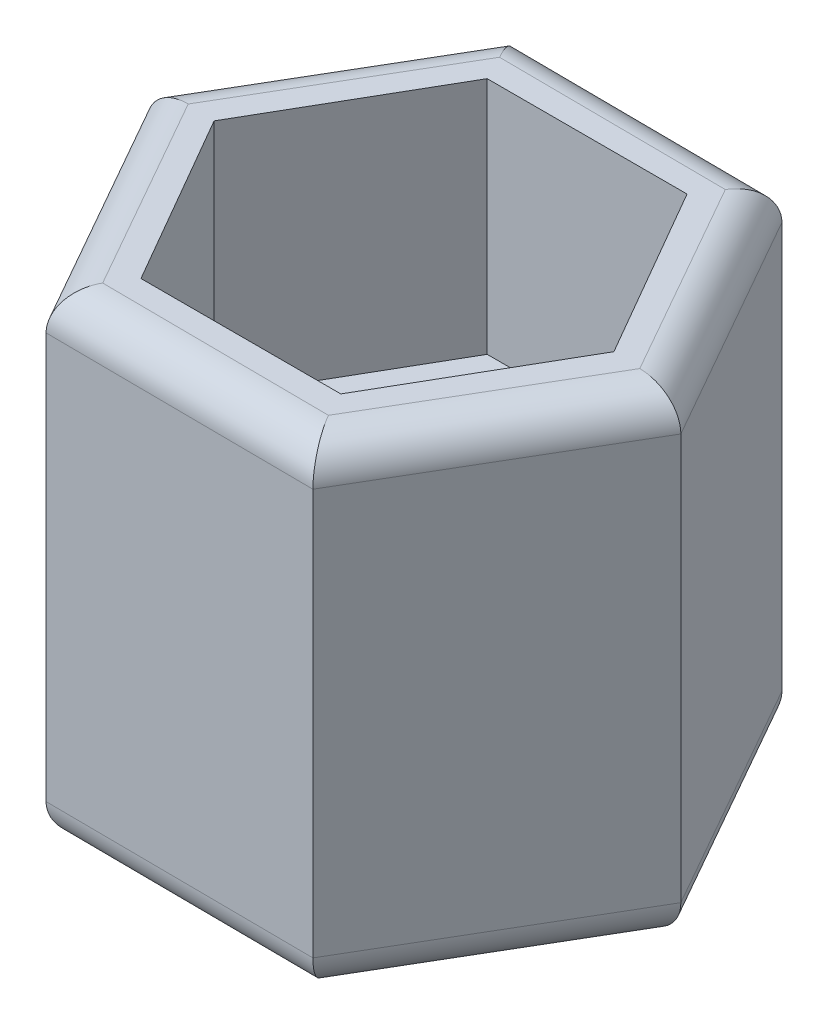
ISO-10303-21;
HEADER;
FILE_DESCRIPTION(('STEP AP214'),'2;1');
FILE_NAME('part.step','',(''),(''),'','','');
FILE_SCHEMA(('AUTOMOTIVE_DESIGN { 1 0 10303 214 1 1 1 1 }'));
ENDSEC;
DATA;
#1=APPLICATION_CONTEXT('core data for automotive mechanical design processes');
#2=APPLICATION_PROTOCOL_DEFINITION('international standard','automotive_design',2000,#1);
#3=PRODUCT_CONTEXT('',#1,'mechanical');
#4=PRODUCT('Part','Part','',(#3));
#5=PRODUCT_RELATED_PRODUCT_CATEGORY('part','',(#4));
#6=PRODUCT_DEFINITION_FORMATION('','',#4);
#7=PRODUCT_DEFINITION_CONTEXT('part definition',#1,'design');
#8=PRODUCT_DEFINITION('design','',#6,#7);
#9=PRODUCT_DEFINITION_SHAPE('','',#8);
#10=(LENGTH_UNIT() NAMED_UNIT(*) SI_UNIT(.MILLI.,.METRE.));
#11=(NAMED_UNIT(*) PLANE_ANGLE_UNIT() SI_UNIT($,.RADIAN.));
#12=(NAMED_UNIT(*) SI_UNIT($,.STERADIAN.) SOLID_ANGLE_UNIT());
#13=UNCERTAINTY_MEASURE_WITH_UNIT(LENGTH_MEASURE(1.E-05),#10,'distance_accuracy_value','');
#14=(GEOMETRIC_REPRESENTATION_CONTEXT(3) GLOBAL_UNCERTAINTY_ASSIGNED_CONTEXT((#13)) GLOBAL_UNIT_ASSIGNED_CONTEXT((#10,
#11,#12)) REPRESENTATION_CONTEXT('',''));
#15=CARTESIAN_POINT('',(0.,0.,0.));
#16=DIRECTION('',(0.,0.,1.));
#17=DIRECTION('',(1.,0.,0.));
#18=AXIS2_PLACEMENT_3D('',#15,#16,#17);
#19=CARTESIAN_POINT('',(-7.11414502554698,18.5,-4.17749213709434));
#20=DIRECTION('',(0.506362683284164,0.,-0.86232060915721));
#21=DIRECTION('',(-0.86232060915721,0.,-0.506362683284164));
#22=AXIS2_PLACEMENT_3D('',#19,#20,#21);
#23=CYLINDRICAL_SURFACE('',#22,1.5);
#24=CARTESIAN_POINT('',(-4.70226881565801,20.,-8.28484568264793));
#25=CARTESIAN_POINT('',(-5.20309159716499,20.,-9.16723663514376));
#26=CARTESIAN_POINT('',(-5.55722678214129,19.3786796564404,-9.7911812613112));
#27=CARTESIAN_POINT('',(-5.55722678214129,18.5,-9.7911812613112));
#28=(BOUNDED_CURVE() B_SPLINE_CURVE(3,(#24,#25,#26,#27),.UNSPECIFIED.,.F.,
.F.) B_SPLINE_CURVE_WITH_KNOTS((4,4),(1.5707963267949,3.1415926535898),
.UNSPECIFIED.) CURVE() GEOMETRIC_REPRESENTATION_ITEM() RATIONAL_B_SPLINE_CURVE((1.,
0.804737854124365,0.804737854124365,1.)) REPRESENTATION_ITEM(''));
#29=CARTESIAN_POINT('',(-4.70226881565801,20.,-8.28484568264793));
#30=VERTEX_POINT('',#29);
#31=CARTESIAN_POINT('',(-5.55722678214129,18.5,-9.7911812613112));
#32=VERTEX_POINT('',#31);
#33=EDGE_CURVE('E410',#30,#32,#28,.T.);
#34=ORIENTED_EDGE('',*,*,#33,.T.);
#35=DIRECTION('',(0.506362683284163,0.,-0.86232060915721));
#36=VECTOR('',#35,1.);
#37=CARTESIAN_POINT('',(-5.55722678214129,18.5,-9.7911812613112));
#38=LINE('',#37,#36);
#39=CARTESIAN_POINT('',(-11.2580250964243,18.5,-0.0828910627299843));
#40=VERTEX_POINT('',#39);
#41=EDGE_CURVE('E306',#40,#32,#38,.T.);
#42=ORIENTED_EDGE('',*,*,#41,.F.);
#43=CARTESIAN_POINT('',(-11.2580250964243,18.5,-0.0828910627299843));
#44=CARTESIAN_POINT('',(-11.2580250964243,19.3786796564404,-0.0828910627299863));
#45=CARTESIAN_POINT('',(-10.5406056071204,20.,-0.0776088162096358));
#46=CARTESIAN_POINT('',(-9.52602123543594,20.,-0.0701385915407576));
#47=(BOUNDED_CURVE() B_SPLINE_CURVE(3,(#43,#44,#45,#46),.UNSPECIFIED.,.F.,
.F.) B_SPLINE_CURVE_WITH_KNOTS((4,4),(0.,1.5707963267949),
.UNSPECIFIED.) CURVE() GEOMETRIC_REPRESENTATION_ITEM() RATIONAL_B_SPLINE_CURVE((1.,
0.804737854124365,0.804737854124365,1.)) REPRESENTATION_ITEM(''));
#48=CARTESIAN_POINT('',(-9.52602123543594,20.,-0.0701385915407576));
#49=VERTEX_POINT('',#48);
#50=EDGE_CURVE('E63',#40,#49,#47,.T.);
#51=ORIENTED_EDGE('',*,*,#50,.T.);
#52=DIRECTION('',(-0.506362683284163,0.,0.86232060915721));
#53=VECTOR('',#52,1.);
#54=CARTESIAN_POINT('',(-9.96454418268848,20.,0.67665296219626));
#55=LINE('',#54,#53);
#56=EDGE_CURVE('E299',#30,#49,#55,.T.);
#57=ORIENTED_EDGE('',*,*,#56,.F.);
#58=EDGE_LOOP('',(#34,#42,#51,#57));
#59=FACE_BOUND('',#58,.T.);
#60=ADVANCED_FACE('F55',(#59),#23,.T.);
#61=CARTESIAN_POINT('',(-7.17488682760694,18.5,4.07228424978321));
#62=DIRECTION('',(-0.493610212094935,0.,-0.869683251831144));
#63=DIRECTION('',(-0.869683251831144,0.,0.493610212094935));
#64=AXIS2_PLACEMENT_3D('',#61,#62,#63);
#65=CYLINDRICAL_SURFACE('',#64,1.5);
#66=CARTESIAN_POINT('',(-5.70079831428301,18.5,9.70829019858121));
#67=CARTESIAN_POINT('',(-5.70079831428301,19.3786796564404,9.7082901985812));
#68=CARTESIAN_POINT('',(-5.33751400995536,20.,9.08962781893411));
#69=CARTESIAN_POINT('',(-4.82375241977793,20.,8.21470709110717));
#70=(BOUNDED_CURVE() B_SPLINE_CURVE(3,(#66,#67,#68,#69),.UNSPECIFIED.,.F.,
.F.) B_SPLINE_CURVE_WITH_KNOTS((4,4),(3.1415926535898,4.71238898038469),
.UNSPECIFIED.) CURVE() GEOMETRIC_REPRESENTATION_ITEM() RATIONAL_B_SPLINE_CURVE((1.,
0.804737854124365,0.804737854124365,1.)) REPRESENTATION_ITEM(''));
#71=CARTESIAN_POINT('',(-5.70079831428301,18.5,9.70829019858121));
#72=VERTEX_POINT('',#71);
#73=CARTESIAN_POINT('',(-4.82375241977793,20.,8.21470709110717));
#74=VERTEX_POINT('',#73);
#75=EDGE_CURVE('E418',#72,#74,#70,.T.);
#76=ORIENTED_EDGE('',*,*,#75,.T.);
#77=DIRECTION('',(0.493610212094935,0.,0.869683251831144));
#78=VECTOR('',#77,1.);
#79=CARTESIAN_POINT('',(-4.39627343653629,20.,8.9678748804388));
#80=LINE('',#79,#78);
#81=EDGE_CURVE('E348',#49,#74,#80,.T.);
#82=ORIENTED_EDGE('',*,*,#81,.F.);
#83=ORIENTED_EDGE('',*,*,#50,.F.);
#84=DIRECTION('',(-0.493610212094935,0.,-0.869683251831144));
#85=VECTOR('',#84,1.);
#86=CARTESIAN_POINT('',(-11.2580250964243,18.5,-0.0828910627299848));
#87=LINE('',#86,#85);
#88=EDGE_CURVE('E281',#72,#40,#87,.T.);
#89=ORIENTED_EDGE('',*,*,#88,.F.);
#90=EDGE_LOOP('',(#76,#82,#83,#89));
#91=FACE_BOUND('',#90,.T.);
#92=ADVANCED_FACE('F481',(#91),#65,.T.);
#93=CARTESIAN_POINT('',(0.0607418020599588,18.5,-8.24977638687755));
#94=DIRECTION('',(0.999972895379098,0.,0.0073626426739344));
#95=DIRECTION('',(0.0073626426739344,0.,-0.999972895379098));
#96=AXIS2_PLACEMENT_3D('',#93,#94,#95);
#97=CYLINDRICAL_SURFACE('',#96,1.5);
#98=CARTESIAN_POINT('',(4.82375241977793,20.,-8.21470709110717));
#99=CARTESIAN_POINT('',(5.33751400995537,20.,-9.08962781893411));
#100=CARTESIAN_POINT('',(5.70079831428301,19.3786796564404,-9.7082901985812));
#101=CARTESIAN_POINT('',(5.70079831428301,18.5,-9.70829019858121));
#102=(BOUNDED_CURVE() B_SPLINE_CURVE(3,(#98,#99,#100,#101),.UNSPECIFIED.,.F.,
.F.) B_SPLINE_CURVE_WITH_KNOTS((4,4),(1.5707963267949,3.1415926535898),
.UNSPECIFIED.) CURVE() GEOMETRIC_REPRESENTATION_ITEM() RATIONAL_B_SPLINE_CURVE((1.,
0.804737854124365,0.804737854124365,1.)) REPRESENTATION_ITEM(''));
#103=CARTESIAN_POINT('',(4.82375241977793,20.,-8.21470709110717));
#104=VERTEX_POINT('',#103);
#105=CARTESIAN_POINT('',(5.70079831428301,18.5,-9.70829019858121));
#106=VERTEX_POINT('',#105);
#107=EDGE_CURVE('E450',#104,#106,#102,.T.);
#108=ORIENTED_EDGE('',*,*,#107,.T.);
#109=DIRECTION('',(0.999972895379098,0.,0.0073626426739344));
#110=VECTOR('',#109,1.);
#111=CARTESIAN_POINT('',(5.70079831428301,18.5,-9.70829019858121));
#112=LINE('',#111,#110);
#113=EDGE_CURVE('E294',#32,#106,#112,.T.);
#114=ORIENTED_EDGE('',*,*,#113,.F.);
#115=ORIENTED_EDGE('',*,*,#33,.F.);
#116=DIRECTION('',(-0.999972895379098,0.,-0.0073626426739344));
#117=VECTOR('',#116,1.);
#118=CARTESIAN_POINT('',(-5.56827074615219,20.,-8.29122191824255));
#119=LINE('',#118,#117);
#120=EDGE_CURVE('E295',#104,#30,#119,.T.);
#121=ORIENTED_EDGE('',*,*,#120,.F.);
#122=EDGE_LOOP('',(#108,#114,#115,#121));
#123=FACE_BOUND('',#122,.T.);
#124=ADVANCED_FACE('F488',(#123),#97,.T.);
#125=CARTESIAN_POINT('',(-0.0607418020599575,18.5,8.24977638687755));
#126=DIRECTION('',(-0.999972895379098,0.,-0.00736264267393425));
#127=DIRECTION('',(-0.00736264267393425,0.,0.999972895379098));
#128=AXIS2_PLACEMENT_3D('',#125,#126,#127);
#129=CYLINDRICAL_SURFACE('',#128,1.5);
#130=CARTESIAN_POINT('',(5.55722678214129,18.5,9.79118126131119));
#131=CARTESIAN_POINT('',(5.55722678214129,19.3786796564404,9.79118126131119));
#132=CARTESIAN_POINT('',(5.203091597165,20.,9.16723663514376));
#133=CARTESIAN_POINT('',(4.70226881565802,20.,8.28484568264793));
#134=(BOUNDED_CURVE() B_SPLINE_CURVE(3,(#130,#131,#132,#133),.UNSPECIFIED.,.F.,
.F.) B_SPLINE_CURVE_WITH_KNOTS((4,4),(3.1415926535898,4.71238898038469),
.UNSPECIFIED.) CURVE() GEOMETRIC_REPRESENTATION_ITEM() RATIONAL_B_SPLINE_CURVE((1.,
0.804737854124365,0.804737854124365,1.)) REPRESENTATION_ITEM(''));
#135=CARTESIAN_POINT('',(5.55722678214129,18.5,9.79118126131119));
#136=VERTEX_POINT('',#135);
#137=CARTESIAN_POINT('',(4.70226881565802,20.,8.28484568264793));
#138=VERTEX_POINT('',#137);
#139=EDGE_CURVE('E434',#136,#138,#134,.T.);
#140=ORIENTED_EDGE('',*,*,#139,.T.);
#141=DIRECTION('',(0.999972895379098,0.,0.00736264267393425));
#142=VECTOR('',#141,1.);
#143=CARTESIAN_POINT('',(5.56827074615219,20.,8.29122191824255));
#144=LINE('',#143,#142);
#145=EDGE_CURVE('E352',#74,#138,#144,.T.);
#146=ORIENTED_EDGE('',*,*,#145,.F.);
#147=ORIENTED_EDGE('',*,*,#75,.F.);
#148=DIRECTION('',(-0.999972895379098,0.,-0.00736264267393425));
#149=VECTOR('',#148,1.);
#150=CARTESIAN_POINT('',(-5.70079831428301,18.5,9.70829019858121));
#151=LINE('',#150,#149);
#152=EDGE_CURVE('E324',#136,#72,#151,.T.);
#153=ORIENTED_EDGE('',*,*,#152,.F.);
#154=EDGE_LOOP('',(#140,#146,#147,#153));
#155=FACE_BOUND('',#154,.T.);
#156=ADVANCED_FACE('F626',(#155),#129,.T.);
#157=CARTESIAN_POINT('',(7.17488682760694,18.5,-4.07228424978321));
#158=DIRECTION('',(0.493610212094934,0.,0.869683251831145));
#159=DIRECTION('',(0.869683251831145,0.,-0.493610212094934));
#160=AXIS2_PLACEMENT_3D('',#157,#158,#159);
#161=CYLINDRICAL_SURFACE('',#160,1.5);
#162=CARTESIAN_POINT('',(9.52602123543595,20.,0.0701385915407602));
#163=CARTESIAN_POINT('',(10.5406056071204,20.,0.0776088162096386));
#164=CARTESIAN_POINT('',(11.2580250964243,19.3786796564404,0.0828910627299895));
#165=CARTESIAN_POINT('',(11.2580250964243,18.5,0.082891062729986));
#166=(BOUNDED_CURVE() B_SPLINE_CURVE(3,(#162,#163,#164,#165),.UNSPECIFIED.,.F.,
.F.) B_SPLINE_CURVE_WITH_KNOTS((4,4),(1.5707963267949,3.1415926535898),
.UNSPECIFIED.) CURVE() GEOMETRIC_REPRESENTATION_ITEM() RATIONAL_B_SPLINE_CURVE((1.,
0.804737854124365,0.804737854124365,1.)) REPRESENTATION_ITEM(''));
#167=CARTESIAN_POINT('',(9.52602123543595,20.,0.0701385915407602));
#168=VERTEX_POINT('',#167);
#169=CARTESIAN_POINT('',(11.2580250964243,18.5,0.082891062729986));
#170=VERTEX_POINT('',#169);
#171=EDGE_CURVE('E442',#168,#170,#166,.T.);
#172=ORIENTED_EDGE('',*,*,#171,.T.);
#173=DIRECTION('',(0.493610212094934,0.,0.869683251831145));
#174=VECTOR('',#173,1.);
#175=CARTESIAN_POINT('',(11.2580250964243,18.5,0.0828910627299882));
#176=LINE('',#175,#174);
#177=EDGE_CURVE('E276',#106,#170,#176,.T.);
#178=ORIENTED_EDGE('',*,*,#177,.F.);
#179=ORIENTED_EDGE('',*,*,#107,.F.);
#180=DIRECTION('',(-0.493610212094934,0.,-0.869683251831145));
#181=VECTOR('',#180,1.);
#182=CARTESIAN_POINT('',(4.39627343653629,20.,-8.96787488043881));
#183=LINE('',#182,#181);
#184=EDGE_CURVE('E360',#168,#104,#183,.T.);
#185=ORIENTED_EDGE('',*,*,#184,.F.);
#186=EDGE_LOOP('',(#172,#178,#179,#185));
#187=FACE_BOUND('',#186,.T.);
#188=ADVANCED_FACE('F631',(#187),#161,.T.);
#189=CARTESIAN_POINT('',(7.11414502554698,18.5,4.17749213709434));
#190=DIRECTION('',(-0.506362683284163,0.,0.86232060915721));
#191=DIRECTION('',(0.86232060915721,0.,0.506362683284163));
#192=AXIS2_PLACEMENT_3D('',#189,#190,#191);
#193=CYLINDRICAL_SURFACE('',#192,1.5);
#194=ORIENTED_EDGE('',*,*,#139,.F.);
#195=DIRECTION('',(-0.506362683284163,0.,0.86232060915721));
#196=VECTOR('',#195,1.);
#197=CARTESIAN_POINT('',(5.55722678214129,18.5,9.79118126131119));
#198=LINE('',#197,#196);
#199=EDGE_CURVE('E300',#170,#136,#198,.T.);
#200=ORIENTED_EDGE('',*,*,#199,.F.);
#201=ORIENTED_EDGE('',*,*,#171,.F.);
#202=DIRECTION('',(0.506362683284163,0.,-0.86232060915721));
#203=VECTOR('',#202,1.);
#204=CARTESIAN_POINT('',(9.96454418268849,20.,-0.676652962196258));
#205=LINE('',#204,#203);
#206=EDGE_CURVE('E356',#138,#168,#205,.T.);
#207=ORIENTED_EDGE('',*,*,#206,.F.);
#208=EDGE_LOOP('',(#194,#200,#201,#207));
#209=FACE_BOUND('',#208,.T.);
#210=ADVANCED_FACE('F635',(#209),#193,.T.);
#211=CARTESIAN_POINT('',(9.95350021867759,1.5,0.823306380872388));
#212=DIRECTION('',(-0.493610212094935,0.,-0.869683251831144));
#213=DIRECTION('',(-0.869683251831144,0.,0.493610212094935));
#214=AXIS2_PLACEMENT_3D('',#211,#212,#213);
#215=CYLINDRICAL_SURFACE('',#214,1.5);
#216=CARTESIAN_POINT('',(11.2580250964243,1.5,0.082891062729986));
#217=CARTESIAN_POINT('',(11.2580250964243,0.621320343559643,0.0828910627299883));
#218=CARTESIAN_POINT('',(10.5406056071204,0.,0.0776088162096375));
#219=CARTESIAN_POINT('',(9.52602123543595,0.,0.0701385915407584));
#220=(BOUNDED_CURVE() B_SPLINE_CURVE(3,(#216,#217,#218,#219),.UNSPECIFIED.,.F.,
.F.) B_SPLINE_CURVE_WITH_KNOTS((4,4),(0.,1.5707963267949),
.UNSPECIFIED.) CURVE() GEOMETRIC_REPRESENTATION_ITEM() RATIONAL_B_SPLINE_CURVE((1.,
0.804737854124365,0.804737854124365,1.)) REPRESENTATION_ITEM(''));
#221=CARTESIAN_POINT('',(11.2580250964243,1.5,0.082891062729986));
#222=VERTEX_POINT('',#221);
#223=CARTESIAN_POINT('',(9.52602123543595,0.,0.0701385915407584));
#224=VERTEX_POINT('',#223);
#225=EDGE_CURVE('E383',#222,#224,#220,.T.);
#226=ORIENTED_EDGE('',*,*,#225,.T.);
#227=DIRECTION('',(0.493610212094934,0.,0.869683251831145));
#228=VECTOR('',#227,1.);
#229=CARTESIAN_POINT('',(7.17488682760694,0.,-4.07228424978321));
#230=LINE('',#229,#228);
#231=CARTESIAN_POINT('',(4.82375241977793,0.,-8.21470709110717));
#232=VERTEX_POINT('',#231);
#233=EDGE_CURVE('E368',#232,#224,#230,.T.);
#234=ORIENTED_EDGE('',*,*,#233,.F.);
#235=CARTESIAN_POINT('',(4.82375241977793,0.,-8.21470709110717));
#236=CARTESIAN_POINT('',(5.33751400995536,0.,-9.08962781893411));
#237=CARTESIAN_POINT('',(5.70079831428301,0.621320343559643,-9.70829019858121));
#238=CARTESIAN_POINT('',(5.70079831428301,1.5,-9.70829019858121));
#239=(BOUNDED_CURVE() B_SPLINE_CURVE(3,(#235,#236,#237,#238),.UNSPECIFIED.,.F.,
.F.) B_SPLINE_CURVE_WITH_KNOTS((4,4),(1.5707963267949,3.1415926535898),
.UNSPECIFIED.) CURVE() GEOMETRIC_REPRESENTATION_ITEM() RATIONAL_B_SPLINE_CURVE((1.,
0.804737854124365,0.804737854124365,1.)) REPRESENTATION_ITEM(''));
#240=CARTESIAN_POINT('',(5.70079831428301,1.5,-9.70829019858121));
#241=VERTEX_POINT('',#240);
#242=EDGE_CURVE('E426',#232,#241,#239,.T.);
#243=ORIENTED_EDGE('',*,*,#242,.T.);
#244=DIRECTION('',(-0.493610212094934,0.,-0.869683251831145));
#245=VECTOR('',#244,1.);
#246=CARTESIAN_POINT('',(11.2580250964243,1.5,0.082891062729986));
#247=LINE('',#246,#245);
#248=EDGE_CURVE('E268',#222,#241,#247,.T.);
#249=ORIENTED_EDGE('',*,*,#248,.F.);
#250=EDGE_LOOP('',(#226,#234,#243,#249));
#251=FACE_BOUND('',#250,.T.);
#252=ADVANCED_FACE('F637',(#251),#215,.T.);
#253=CARTESIAN_POINT('',(5.68975435027211,1.5,-8.20833085551256));
#254=DIRECTION('',(-0.999972895379098,0.,-0.00736264267393467));
#255=DIRECTION('',(-0.00736264267393467,0.,0.999972895379098));
#256=AXIS2_PLACEMENT_3D('',#253,#254,#255);
#257=CYLINDRICAL_SURFACE('',#256,1.5);
#258=CARTESIAN_POINT('',(-4.70226881565801,0.,-8.28484568264793));
#259=CARTESIAN_POINT('',(-5.203091597165,0.,-9.16723663514374));
#260=CARTESIAN_POINT('',(-5.55722678214129,0.621320343559643,-9.79118126131119));
#261=CARTESIAN_POINT('',(-5.55722678214129,1.5,-9.7911812613112));
#262=(BOUNDED_CURVE() B_SPLINE_CURVE(3,(#258,#259,#260,#261),.UNSPECIFIED.,.F.,
.F.) B_SPLINE_CURVE_WITH_KNOTS((4,4),(1.5707963267949,3.1415926535898),
.UNSPECIFIED.) CURVE() GEOMETRIC_REPRESENTATION_ITEM() RATIONAL_B_SPLINE_CURVE((1.,
0.804737854124365,0.804737854124365,1.)) REPRESENTATION_ITEM(''));
#263=CARTESIAN_POINT('',(-4.70226881565801,0.,-8.28484568264793));
#264=VERTEX_POINT('',#263);
#265=CARTESIAN_POINT('',(-5.55722678214129,1.5,-9.7911812613112));
#266=VERTEX_POINT('',#265);
#267=EDGE_CURVE('E378',#264,#266,#262,.T.);
#268=ORIENTED_EDGE('',*,*,#267,.T.);
#269=DIRECTION('',(-0.999972895379098,0.,-0.0073626426739344));
#270=VECTOR('',#269,1.);
#271=CARTESIAN_POINT('',(5.70079831428301,1.5,-9.70829019858121));
#272=LINE('',#271,#270);
#273=EDGE_CURVE('E280',#241,#266,#272,.T.);
#274=ORIENTED_EDGE('',*,*,#273,.F.);
#275=ORIENTED_EDGE('',*,*,#242,.F.);
#276=DIRECTION('',(0.999972895379098,0.,0.0073626426739344));
#277=VECTOR('',#276,1.);
#278=CARTESIAN_POINT('',(0.0607418020599588,0.,-8.24977638687755));
#279=LINE('',#278,#277);
#280=EDGE_CURVE('E364',#264,#232,#279,.T.);
#281=ORIENTED_EDGE('',*,*,#280,.F.);
#282=EDGE_LOOP('',(#268,#274,#275,#281));
#283=FACE_BOUND('',#282,.T.);
#284=ADVANCED_FACE('F640',(#283),#257,.T.);
#285=CARTESIAN_POINT('',(4.26374586840548,1.5,9.03163723638495));
#286=DIRECTION('',(0.506362683284163,0.,-0.86232060915721));
#287=DIRECTION('',(-0.862320609157211,0.,-0.506362683284163));
#288=AXIS2_PLACEMENT_3D('',#285,#286,#287);
#289=CYLINDRICAL_SURFACE('',#288,1.5);
#290=CARTESIAN_POINT('',(5.55722678214129,1.5,9.79118126131119));
#291=CARTESIAN_POINT('',(5.55722678214129,0.621320343559643,9.79118126131119));
#292=CARTESIAN_POINT('',(5.203091597165,0.,9.16723663514374));
#293=CARTESIAN_POINT('',(4.70226881565802,0.,8.28484568264793));
#294=(BOUNDED_CURVE() B_SPLINE_CURVE(3,(#290,#291,#292,#293),.UNSPECIFIED.,.F.,
.F.) B_SPLINE_CURVE_WITH_KNOTS((4,4),(3.1415926535898,4.71238898038469),
.UNSPECIFIED.) CURVE() GEOMETRIC_REPRESENTATION_ITEM() RATIONAL_B_SPLINE_CURVE((1.,
0.804737854124365,0.804737854124365,1.)) REPRESENTATION_ITEM(''));
#295=CARTESIAN_POINT('',(5.55722678214129,1.5,9.79118126131119));
#296=VERTEX_POINT('',#295);
#297=CARTESIAN_POINT('',(4.70226881565802,0.,8.28484568264793));
#298=VERTEX_POINT('',#297);
#299=EDGE_CURVE('E334',#296,#298,#294,.T.);
#300=ORIENTED_EDGE('',*,*,#299,.T.);
#301=DIRECTION('',(-0.506362683284163,0.,0.86232060915721));
#302=VECTOR('',#301,1.);
#303=CARTESIAN_POINT('',(7.11414502554698,0.,4.17749213709434));
#304=LINE('',#303,#302);
#305=EDGE_CURVE('E372',#224,#298,#304,.T.);
#306=ORIENTED_EDGE('',*,*,#305,.F.);
#307=ORIENTED_EDGE('',*,*,#225,.F.);
#308=DIRECTION('',(0.506362683284163,0.,-0.86232060915721));
#309=VECTOR('',#308,1.);
#310=CARTESIAN_POINT('',(5.55722678214129,1.5,9.79118126131119));
#311=LINE('',#310,#309);
#312=EDGE_CURVE('E328',#296,#222,#311,.T.);
#313=ORIENTED_EDGE('',*,*,#312,.F.);
#314=EDGE_LOOP('',(#300,#306,#307,#313));
#315=FACE_BOUND('',#314,.T.);
#316=ADVANCED_FACE('F644',(#315),#289,.T.);
#317=CARTESIAN_POINT('',(-4.26374586840548,1.5,-9.03163723638495));
#318=DIRECTION('',(-0.506362683284163,0.,0.862320609157211));
#319=DIRECTION('',(0.862320609157211,0.,0.506362683284163));
#320=AXIS2_PLACEMENT_3D('',#317,#318,#319);
#321=CYLINDRICAL_SURFACE('',#320,1.5);
#322=CARTESIAN_POINT('',(-9.52602123543595,0.,-0.0701385915407558));
#323=CARTESIAN_POINT('',(-10.5406056071204,0.,-0.0776088162096339));
#324=CARTESIAN_POINT('',(-11.2580250964243,0.621320343559643,-0.0828910627299844));
#325=CARTESIAN_POINT('',(-11.2580250964243,1.5,-0.0828910627299843));
#326=(BOUNDED_CURVE() B_SPLINE_CURVE(3,(#322,#323,#324,#325),.UNSPECIFIED.,.F.,
.F.) B_SPLINE_CURVE_WITH_KNOTS((4,4),(1.5707963267949,3.1415926535898),
.UNSPECIFIED.) CURVE() GEOMETRIC_REPRESENTATION_ITEM() RATIONAL_B_SPLINE_CURVE((1.,
0.804737854124365,0.804737854124365,1.)) REPRESENTATION_ITEM(''));
#327=CARTESIAN_POINT('',(-9.52602123543595,0.,-0.0701385915407558));
#328=VERTEX_POINT('',#327);
#329=CARTESIAN_POINT('',(-11.2580250964243,1.5,-0.0828910627299843));
#330=VERTEX_POINT('',#329);
#331=EDGE_CURVE('E335',#328,#330,#326,.T.);
#332=ORIENTED_EDGE('',*,*,#331,.T.);
#333=DIRECTION('',(-0.506362683284163,0.,0.86232060915721));
#334=VECTOR('',#333,1.);
#335=CARTESIAN_POINT('',(-5.55722678214129,1.5,-9.7911812613112));
#336=LINE('',#335,#334);
#337=EDGE_CURVE('E301',#266,#330,#336,.T.);
#338=ORIENTED_EDGE('',*,*,#337,.F.);
#339=ORIENTED_EDGE('',*,*,#267,.F.);
#340=DIRECTION('',(0.506362683284163,0.,-0.86232060915721));
#341=VECTOR('',#340,1.);
#342=CARTESIAN_POINT('',(-7.11414502554698,0.,-4.17749213709434));
#343=LINE('',#342,#341);
#344=EDGE_CURVE('E390',#328,#264,#343,.T.);
#345=ORIENTED_EDGE('',*,*,#344,.F.);
#346=EDGE_LOOP('',(#332,#338,#339,#345));
#347=FACE_BOUND('',#346,.T.);
#348=ADVANCED_FACE('F648',(#347),#321,.T.);
#349=CARTESIAN_POINT('',(-5.68975435027211,1.5,8.20833085551256));
#350=DIRECTION('',(0.999972895379098,0.,0.00736264267393409));
#351=DIRECTION('',(0.00736264267393409,0.,-0.999972895379098));
#352=AXIS2_PLACEMENT_3D('',#349,#350,#351);
#353=CYLINDRICAL_SURFACE('',#352,1.5);
#354=CARTESIAN_POINT('',(-5.70079831428301,1.5,9.70829019858121));
#355=CARTESIAN_POINT('',(-5.700798314283,0.621320343559643,9.7082901985812));
#356=CARTESIAN_POINT('',(-5.33751400995536,0.,9.08962781893411));
#357=CARTESIAN_POINT('',(-4.82375241977793,0.,8.21470709110717));
#358=(BOUNDED_CURVE() B_SPLINE_CURVE(3,(#354,#355,#356,#357),.UNSPECIFIED.,.F.,
.F.) B_SPLINE_CURVE_WITH_KNOTS((4,4),(3.1415926535898,4.71238898038469),
.UNSPECIFIED.) CURVE() GEOMETRIC_REPRESENTATION_ITEM() RATIONAL_B_SPLINE_CURVE((1.,
0.804737854124365,0.804737854124365,1.)) REPRESENTATION_ITEM(''));
#359=CARTESIAN_POINT('',(-5.70079831428301,1.5,9.70829019858121));
#360=VERTEX_POINT('',#359);
#361=CARTESIAN_POINT('',(-4.82375241977793,0.,8.21470709110717));
#362=VERTEX_POINT('',#361);
#363=EDGE_CURVE('E329',#360,#362,#358,.T.);
#364=ORIENTED_EDGE('',*,*,#363,.T.);
#365=DIRECTION('',(-0.999972895379098,0.,-0.00736264267393425));
#366=VECTOR('',#365,1.);
#367=CARTESIAN_POINT('',(-0.0607418020599575,0.,8.24977638687755));
#368=LINE('',#367,#366);
#369=EDGE_CURVE('E373',#298,#362,#368,.T.);
#370=ORIENTED_EDGE('',*,*,#369,.F.);
#371=ORIENTED_EDGE('',*,*,#299,.F.);
#372=DIRECTION('',(0.999972895379098,0.,0.00736264267393425));
#373=VECTOR('',#372,1.);
#374=CARTESIAN_POINT('',(-5.70079831428301,1.5,9.70829019858121));
#375=LINE('',#374,#373);
#376=EDGE_CURVE('E285',#360,#296,#375,.T.);
#377=ORIENTED_EDGE('',*,*,#376,.F.);
#378=EDGE_LOOP('',(#364,#370,#371,#377));
#379=FACE_BOUND('',#378,.T.);
#380=ADVANCED_FACE('F652',(#379),#353,.T.);
#381=CARTESIAN_POINT('',(-9.95350021867758,1.5,-0.823306380872386));
#382=DIRECTION('',(0.493610212094935,0.,0.869683251831144));
#383=DIRECTION('',(0.869683251831144,0.,-0.493610212094935));
#384=AXIS2_PLACEMENT_3D('',#381,#382,#383);
#385=CYLINDRICAL_SURFACE('',#384,1.5);
#386=ORIENTED_EDGE('',*,*,#331,.F.);
#387=DIRECTION('',(-0.493610212094935,0.,-0.869683251831144));
#388=VECTOR('',#387,1.);
#389=CARTESIAN_POINT('',(-7.17488682760694,0.,4.07228424978321));
#390=LINE('',#389,#388);
#391=EDGE_CURVE('E377',#362,#328,#390,.T.);
#392=ORIENTED_EDGE('',*,*,#391,.F.);
#393=ORIENTED_EDGE('',*,*,#363,.F.);
#394=DIRECTION('',(0.493610212094935,0.,0.869683251831144));
#395=VECTOR('',#394,1.);
#396=CARTESIAN_POINT('',(-11.2580250964243,1.5,-0.0828910627299843));
#397=LINE('',#396,#395);
#398=EDGE_CURVE('E310',#330,#360,#397,.T.);
#399=ORIENTED_EDGE('',*,*,#398,.F.);
#400=EDGE_LOOP('',(#386,#392,#393,#399));
#401=FACE_BOUND('',#400,.T.);
#402=ADVANCED_FACE('F616',(#401),#385,.T.);
#403=CARTESIAN_POINT('',(0.,0.,0.));
#404=DIRECTION('',(0.,1.,0.));
#405=DIRECTION('',(1.,0.,0.));
#406=AXIS2_PLACEMENT_3D('',#403,#404,#405);
#407=PLANE('',#406);
#408=ORIENTED_EDGE('',*,*,#280,.T.);
#409=ORIENTED_EDGE('',*,*,#233,.T.);
#410=ORIENTED_EDGE('',*,*,#305,.T.);
#411=ORIENTED_EDGE('',*,*,#369,.T.);
#412=ORIENTED_EDGE('',*,*,#391,.T.);
#413=ORIENTED_EDGE('',*,*,#344,.T.);
#414=EDGE_LOOP('',(#408,#409,#410,#411,#412,#413));
#415=FACE_BOUND('',#414,.T.);
#416=ADVANCED_FACE('F608',(#415),#407,.F.);
#417=CARTESIAN_POINT('',(0.,20.,0.));
#418=DIRECTION('',(0.,1.,0.));
#419=DIRECTION('',(1.,0.,0.));
#420=AXIS2_PLACEMENT_3D('',#417,#418,#419);
#421=PLANE('',#420);
#422=DIRECTION('',(0.5,0.,-0.866025403784439));
#423=VECTOR('',#422,1.);
#424=CARTESIAN_POINT('',(4.18578945162479,20.,7.25));
#425=LINE('',#424,#423);
#426=CARTESIAN_POINT('',(4.18578945162479,20.,7.25));
#427=VERTEX_POINT('',#426);
#428=CARTESIAN_POINT('',(8.37157890324957,20.,0.));
#429=VERTEX_POINT('',#428);
#430=EDGE_CURVE('E553',#427,#429,#425,.T.);
#431=ORIENTED_EDGE('',*,*,#430,.F.);
#432=DIRECTION('',(1.,0.,0.));
#433=VECTOR('',#432,1.);
#434=CARTESIAN_POINT('',(-4.18578945162479,20.,7.25));
#435=LINE('',#434,#433);
#436=CARTESIAN_POINT('',(-4.18578945162479,20.,7.25));
#437=VERTEX_POINT('',#436);
#438=EDGE_CURVE('E523',#437,#427,#435,.T.);
#439=ORIENTED_EDGE('',*,*,#438,.F.);
#440=DIRECTION('',(0.5,0.,0.866025403784438));
#441=VECTOR('',#440,1.);
#442=CARTESIAN_POINT('',(-8.37157890324958,20.,0.));
#443=LINE('',#442,#441);
#444=CARTESIAN_POINT('',(-8.37157890324958,20.,0.));
#445=VERTEX_POINT('',#444);
#446=EDGE_CURVE('E565',#445,#437,#443,.T.);
#447=ORIENTED_EDGE('',*,*,#446,.F.);
#448=DIRECTION('',(-0.5,0.,0.866025403784438));
#449=VECTOR('',#448,1.);
#450=CARTESIAN_POINT('',(-4.18578945162479,20.,-7.25));
#451=LINE('',#450,#449);
#452=CARTESIAN_POINT('',(-4.18578945162479,20.,-7.25));
#453=VERTEX_POINT('',#452);
#454=EDGE_CURVE('E562',#453,#445,#451,.T.);
#455=ORIENTED_EDGE('',*,*,#454,.F.);
#456=DIRECTION('',(-1.,0.,0.));
#457=VECTOR('',#456,1.);
#458=CARTESIAN_POINT('',(4.18578945162478,20.,-7.25));
#459=LINE('',#458,#457);
#460=CARTESIAN_POINT('',(4.18578945162478,20.,-7.25));
#461=VERTEX_POINT('',#460);
#462=EDGE_CURVE('E559',#461,#453,#459,.T.);
#463=ORIENTED_EDGE('',*,*,#462,.F.);
#464=DIRECTION('',(-0.5,0.,-0.866025403784438));
#465=VECTOR('',#464,1.);
#466=CARTESIAN_POINT('',(8.37157890324957,20.,0.));
#467=LINE('',#466,#465);
#468=EDGE_CURVE('E556',#429,#461,#467,.T.);
#469=ORIENTED_EDGE('',*,*,#468,.F.);
#470=EDGE_LOOP('',(#431,#439,#447,#455,#463,#469));
#471=FACE_BOUND('',#470,.T.);
#472=ORIENTED_EDGE('',*,*,#120,.T.);
#473=ORIENTED_EDGE('',*,*,#56,.T.);
#474=ORIENTED_EDGE('',*,*,#81,.T.);
#475=ORIENTED_EDGE('',*,*,#145,.T.);
#476=ORIENTED_EDGE('',*,*,#206,.T.);
#477=ORIENTED_EDGE('',*,*,#184,.T.);
#478=EDGE_LOOP('',(#472,#473,#474,#475,#476,#477));
#479=FACE_BOUND('',#478,.T.);
#480=ADVANCED_FACE('F484',(#471,#479),#421,.T.);
#481=CARTESIAN_POINT('',(5.55722678214129,20.,9.79118126131119));
#482=DIRECTION('',(-0.86232060915721,0.,-0.506362683284163));
#483=DIRECTION('',(-0.506362683284163,0.,0.86232060915721));
#484=AXIS2_PLACEMENT_3D('',#481,#482,#483);
#485=PLANE('',#484);
#486=DIRECTION('',(0.,-1.,0.));
#487=VECTOR('',#486,1.);
#488=CARTESIAN_POINT('',(5.55722678214129,20.,9.79118126131119));
#489=LINE('',#488,#487);
#490=EDGE_CURVE('E320',#136,#296,#489,.T.);
#491=ORIENTED_EDGE('',*,*,#490,.T.);
#492=ORIENTED_EDGE('',*,*,#312,.T.);
#493=DIRECTION('',(0.,-1.,0.));
#494=VECTOR('',#493,1.);
#495=CARTESIAN_POINT('',(11.2580250964243,20.,0.082891062729986));
#496=LINE('',#495,#494);
#497=EDGE_CURVE('E264',#170,#222,#496,.T.);
#498=ORIENTED_EDGE('',*,*,#497,.F.);
#499=ORIENTED_EDGE('',*,*,#199,.T.);
#500=EDGE_LOOP('',(#491,#492,#498,#499));
#501=FACE_BOUND('',#500,.T.);
#502=ADVANCED_FACE('F607',(#501),#485,.F.);
#503=CARTESIAN_POINT('',(-5.70079831428301,20.,9.70829019858121));
#504=DIRECTION('',(0.00736264267393425,0.,-0.999972895379098));
#505=DIRECTION('',(0.,-1.,0.));
#506=AXIS2_PLACEMENT_3D('',#503,#504,#505);
#507=PLANE('',#506);
#508=DIRECTION('',(0.,-1.,0.));
#509=VECTOR('',#508,1.);
#510=CARTESIAN_POINT('',(-5.70079831428301,20.,9.70829019858121));
#511=LINE('',#510,#509);
#512=EDGE_CURVE('E286',#72,#360,#511,.T.);
#513=ORIENTED_EDGE('',*,*,#512,.T.);
#514=ORIENTED_EDGE('',*,*,#376,.T.);
#515=ORIENTED_EDGE('',*,*,#490,.F.);
#516=ORIENTED_EDGE('',*,*,#152,.T.);
#517=EDGE_LOOP('',(#513,#514,#515,#516));
#518=FACE_BOUND('',#517,.T.);
#519=ADVANCED_FACE('F613',(#518),#507,.F.);
#520=CARTESIAN_POINT('',(-11.2580250964243,20.,-0.0828910627299843));
#521=DIRECTION('',(0.869683251831144,0.,-0.493610212094935));
#522=DIRECTION('',(0.,-1.,0.));
#523=AXIS2_PLACEMENT_3D('',#520,#521,#522);
#524=PLANE('',#523);
#525=DIRECTION('',(0.,-1.,0.));
#526=VECTOR('',#525,1.);
#527=CARTESIAN_POINT('',(-11.2580250964243,20.,-0.0828910627299843));
#528=LINE('',#527,#526);
#529=EDGE_CURVE('E305',#40,#330,#528,.T.);
#530=ORIENTED_EDGE('',*,*,#529,.T.);
#531=ORIENTED_EDGE('',*,*,#398,.T.);
#532=ORIENTED_EDGE('',*,*,#512,.F.);
#533=ORIENTED_EDGE('',*,*,#88,.T.);
#534=EDGE_LOOP('',(#530,#531,#532,#533));
#535=FACE_BOUND('',#534,.T.);
#536=ADVANCED_FACE('F674',(#535),#524,.F.);
#537=CARTESIAN_POINT('',(-5.55722678214129,20.,-9.7911812613112));
#538=DIRECTION('',(0.86232060915721,0.,0.506362683284163));
#539=DIRECTION('',(0.,-1.,0.));
#540=AXIS2_PLACEMENT_3D('',#537,#538,#539);
#541=PLANE('',#540);
#542=DIRECTION('',(0.,-1.,0.));
#543=VECTOR('',#542,1.);
#544=CARTESIAN_POINT('',(-5.55722678214129,20.,-9.7911812613112));
#545=LINE('',#544,#543);
#546=EDGE_CURVE('E290',#32,#266,#545,.T.);
#547=ORIENTED_EDGE('',*,*,#546,.T.);
#548=ORIENTED_EDGE('',*,*,#337,.T.);
#549=ORIENTED_EDGE('',*,*,#529,.F.);
#550=ORIENTED_EDGE('',*,*,#41,.T.);
#551=EDGE_LOOP('',(#547,#548,#549,#550));
#552=FACE_BOUND('',#551,.T.);
#553=ADVANCED_FACE('F493',(#552),#541,.F.);
#554=CARTESIAN_POINT('',(5.70079831428301,20.,-9.70829019858121));
#555=DIRECTION('',(-0.0073626426739344,0.,0.999972895379098));
#556=DIRECTION('',(0.,1.,0.));
#557=AXIS2_PLACEMENT_3D('',#554,#555,#556);
#558=PLANE('',#557);
#559=DIRECTION('',(0.,-1.,0.));
#560=VECTOR('',#559,1.);
#561=CARTESIAN_POINT('',(5.70079831428301,20.,-9.70829019858121));
#562=LINE('',#561,#560);
#563=EDGE_CURVE('E272',#106,#241,#562,.T.);
#564=ORIENTED_EDGE('',*,*,#563,.T.);
#565=ORIENTED_EDGE('',*,*,#273,.T.);
#566=ORIENTED_EDGE('',*,*,#546,.F.);
#567=ORIENTED_EDGE('',*,*,#113,.T.);
#568=EDGE_LOOP('',(#564,#565,#566,#567));
#569=FACE_BOUND('',#568,.T.);
#570=ADVANCED_FACE('F681',(#569),#558,.F.);
#571=CARTESIAN_POINT('',(11.2580250964243,20.,0.082891062729986));
#572=DIRECTION('',(-0.869683251831145,0.,0.493610212094934));
#573=DIRECTION('',(0.,1.,0.));
#574=AXIS2_PLACEMENT_3D('',#571,#572,#573);
#575=PLANE('',#574);
#576=ORIENTED_EDGE('',*,*,#497,.T.);
#577=ORIENTED_EDGE('',*,*,#248,.T.);
#578=ORIENTED_EDGE('',*,*,#563,.F.);
#579=ORIENTED_EDGE('',*,*,#177,.T.);
#580=EDGE_LOOP('',(#576,#577,#578,#579));
#581=FACE_BOUND('',#580,.T.);
#582=ADVANCED_FACE('F684',(#581),#575,.F.);
#583=CARTESIAN_POINT('',(0.,10.,0.));
#584=DIRECTION('',(0.,1.,0.));
#585=DIRECTION('',(0.,0.,1.));
#586=AXIS2_PLACEMENT_3D('',#583,#584,#585);
#587=PLANE('',#586);
#588=CARTESIAN_POINT('',(0.,10.,0.));
#589=DIRECTION('',(0.,1.,0.));
#590=DIRECTION('',(0.,0.,1.));
#591=AXIS2_PLACEMENT_3D('',#588,#589,#590);
#592=CIRCLE('',#591,5.);
#593=CARTESIAN_POINT('',(0.,10.,5.));
#594=VERTEX_POINT('',#593);
#595=EDGE_CURVE('E700',#594,#594,#592,.T.);
#596=ORIENTED_EDGE('',*,*,#595,.F.);
#597=EDGE_LOOP('',(#596));
#598=FACE_BOUND('',#597,.T.);
#599=DIRECTION('',(0.5,0.,-0.866025403784439));
#600=VECTOR('',#599,1.);
#601=CARTESIAN_POINT('',(4.18578945162479,10.,7.25));
#602=LINE('',#601,#600);
#603=CARTESIAN_POINT('',(4.18578945162479,10.,7.25));
#604=VERTEX_POINT('',#603);
#605=CARTESIAN_POINT('',(8.37157890324957,10.,0.));
#606=VERTEX_POINT('',#605);
#607=EDGE_CURVE('E573',#604,#606,#602,.T.);
#608=ORIENTED_EDGE('',*,*,#607,.T.);
#609=DIRECTION('',(-0.5,0.,-0.866025403784438));
#610=VECTOR('',#609,1.);
#611=CARTESIAN_POINT('',(8.37157890324957,10.,0.));
#612=LINE('',#611,#610);
#613=CARTESIAN_POINT('',(4.18578945162478,10.,-7.25));
#614=VERTEX_POINT('',#613);
#615=EDGE_CURVE('E577',#606,#614,#612,.T.);
#616=ORIENTED_EDGE('',*,*,#615,.T.);
#617=DIRECTION('',(-1.,0.,0.));
#618=VECTOR('',#617,1.);
#619=CARTESIAN_POINT('',(4.18578945162478,10.,-7.25));
#620=LINE('',#619,#618);
#621=CARTESIAN_POINT('',(-4.18578945162479,10.,-7.25));
#622=VERTEX_POINT('',#621);
#623=EDGE_CURVE('E581',#614,#622,#620,.T.);
#624=ORIENTED_EDGE('',*,*,#623,.T.);
#625=DIRECTION('',(-0.5,0.,0.866025403784438));
#626=VECTOR('',#625,1.);
#627=CARTESIAN_POINT('',(-4.18578945162479,10.,-7.25));
#628=LINE('',#627,#626);
#629=CARTESIAN_POINT('',(-8.37157890324958,10.,0.));
#630=VERTEX_POINT('',#629);
#631=EDGE_CURVE('E549',#622,#630,#628,.T.);
#632=ORIENTED_EDGE('',*,*,#631,.T.);
#633=DIRECTION('',(0.5,0.,0.866025403784438));
#634=VECTOR('',#633,1.);
#635=CARTESIAN_POINT('',(-8.37157890324958,10.,0.));
#636=LINE('',#635,#634);
#637=CARTESIAN_POINT('',(-4.18578945162479,10.,7.25));
#638=VERTEX_POINT('',#637);
#639=EDGE_CURVE('E542',#630,#638,#636,.T.);
#640=ORIENTED_EDGE('',*,*,#639,.T.);
#641=DIRECTION('',(1.,0.,0.));
#642=VECTOR('',#641,1.);
#643=CARTESIAN_POINT('',(-4.18578945162479,10.,7.25));
#644=LINE('',#643,#642);
#645=EDGE_CURVE('E535',#638,#604,#644,.T.);
#646=ORIENTED_EDGE('',*,*,#645,.T.);
#647=EDGE_LOOP('',(#608,#616,#624,#632,#640,#646));
#648=FACE_BOUND('',#647,.T.);
#649=ADVANCED_FACE('F592',(#598,#648),#587,.T.);
#650=CARTESIAN_POINT('',(8.37157890324957,10.,0.));
#651=DIRECTION('',(0.866025403784438,0.,-0.5));
#652=DIRECTION('',(-0.5,0.,-0.866025403784439));
#653=AXIS2_PLACEMENT_3D('',#650,#651,#652);
#654=PLANE('',#653);
#655=ORIENTED_EDGE('',*,*,#468,.T.);
#656=DIRECTION('',(0.,1.,0.));
#657=VECTOR('',#656,1.);
#658=CARTESIAN_POINT('',(4.18578945162478,10.,-7.25));
#659=LINE('',#658,#657);
#660=EDGE_CURVE('E531',#614,#461,#659,.T.);
#661=ORIENTED_EDGE('',*,*,#660,.F.);
#662=ORIENTED_EDGE('',*,*,#615,.F.);
#663=DIRECTION('',(0.,1.,0.));
#664=VECTOR('',#663,1.);
#665=CARTESIAN_POINT('',(8.37157890324957,10.,0.));
#666=LINE('',#665,#664);
#667=EDGE_CURVE('E533',#606,#429,#666,.T.);
#668=ORIENTED_EDGE('',*,*,#667,.T.);
#669=EDGE_LOOP('',(#655,#661,#662,#668));
#670=FACE_BOUND('',#669,.T.);
#671=ADVANCED_FACE('F601',(#670),#654,.F.);
#672=CARTESIAN_POINT('',(4.18578945162478,10.,-7.25));
#673=DIRECTION('',(0.,0.,-1.));
#674=DIRECTION('',(-1.,0.,0.));
#675=AXIS2_PLACEMENT_3D('',#672,#673,#674);
#676=PLANE('',#675);
#677=ORIENTED_EDGE('',*,*,#462,.T.);
#678=DIRECTION('',(0.,1.,0.));
#679=VECTOR('',#678,1.);
#680=CARTESIAN_POINT('',(-4.18578945162479,10.,-7.25));
#681=LINE('',#680,#679);
#682=EDGE_CURVE('E528',#622,#453,#681,.T.);
#683=ORIENTED_EDGE('',*,*,#682,.F.);
#684=ORIENTED_EDGE('',*,*,#623,.F.);
#685=ORIENTED_EDGE('',*,*,#660,.T.);
#686=EDGE_LOOP('',(#677,#683,#684,#685));
#687=FACE_BOUND('',#686,.T.);
#688=ADVANCED_FACE('F604',(#687),#676,.F.);
#689=CARTESIAN_POINT('',(-4.18578945162479,10.,-7.25));
#690=DIRECTION('',(-0.866025403784438,0.,-0.5));
#691=DIRECTION('',(-0.5,0.,0.866025403784439));
#692=AXIS2_PLACEMENT_3D('',#689,#690,#691);
#693=PLANE('',#692);
#694=ORIENTED_EDGE('',*,*,#454,.T.);
#695=DIRECTION('',(0.,1.,0.));
#696=VECTOR('',#695,1.);
#697=CARTESIAN_POINT('',(-8.37157890324958,10.,0.));
#698=LINE('',#697,#696);
#699=EDGE_CURVE('E520',#630,#445,#698,.T.);
#700=ORIENTED_EDGE('',*,*,#699,.F.);
#701=ORIENTED_EDGE('',*,*,#631,.F.);
#702=ORIENTED_EDGE('',*,*,#682,.T.);
#703=EDGE_LOOP('',(#694,#700,#701,#702));
#704=FACE_BOUND('',#703,.T.);
#705=ADVANCED_FACE('F596',(#704),#693,.F.);
#706=CARTESIAN_POINT('',(-8.37157890324958,10.,0.));
#707=DIRECTION('',(-0.866025403784438,0.,0.5));
#708=DIRECTION('',(0.5,0.,0.866025403784438));
#709=AXIS2_PLACEMENT_3D('',#706,#707,#708);
#710=PLANE('',#709);
#711=ORIENTED_EDGE('',*,*,#446,.T.);
#712=DIRECTION('',(0.,1.,0.));
#713=VECTOR('',#712,1.);
#714=CARTESIAN_POINT('',(-4.18578945162479,10.,7.25));
#715=LINE('',#714,#713);
#716=EDGE_CURVE('E514',#638,#437,#715,.T.);
#717=ORIENTED_EDGE('',*,*,#716,.F.);
#718=ORIENTED_EDGE('',*,*,#639,.F.);
#719=ORIENTED_EDGE('',*,*,#699,.T.);
#720=EDGE_LOOP('',(#711,#717,#718,#719));
#721=FACE_BOUND('',#720,.T.);
#722=ADVANCED_FACE('F598',(#721),#710,.F.);
#723=CARTESIAN_POINT('',(-4.18578945162479,10.,7.25));
#724=DIRECTION('',(0.,0.,1.));
#725=DIRECTION('',(1.,0.,0.));
#726=AXIS2_PLACEMENT_3D('',#723,#724,#725);
#727=PLANE('',#726);
#728=ORIENTED_EDGE('',*,*,#438,.T.);
#729=DIRECTION('',(0.,1.,0.));
#730=VECTOR('',#729,1.);
#731=CARTESIAN_POINT('',(4.18578945162479,10.,7.25));
#732=LINE('',#731,#730);
#733=EDGE_CURVE('E509',#604,#427,#732,.T.);
#734=ORIENTED_EDGE('',*,*,#733,.F.);
#735=ORIENTED_EDGE('',*,*,#645,.F.);
#736=ORIENTED_EDGE('',*,*,#716,.T.);
#737=EDGE_LOOP('',(#728,#734,#735,#736));
#738=FACE_BOUND('',#737,.T.);
#739=ADVANCED_FACE('F599',(#738),#727,.F.);
#740=CARTESIAN_POINT('',(4.18578945162479,10.,7.25));
#741=DIRECTION('',(0.866025403784439,0.,0.5));
#742=DIRECTION('',(0.5,0.,-0.866025403784439));
#743=AXIS2_PLACEMENT_3D('',#740,#741,#742);
#744=PLANE('',#743);
#745=ORIENTED_EDGE('',*,*,#430,.T.);
#746=ORIENTED_EDGE('',*,*,#667,.F.);
#747=ORIENTED_EDGE('',*,*,#607,.F.);
#748=ORIENTED_EDGE('',*,*,#733,.T.);
#749=EDGE_LOOP('',(#745,#746,#747,#748));
#750=FACE_BOUND('',#749,.T.);
#751=ADVANCED_FACE('F600',(#750),#744,.F.);
#752=CARTESIAN_POINT('',(0.,5.,0.));
#753=DIRECTION('',(0.,1.,0.));
#754=DIRECTION('',(0.,0.,1.));
#755=AXIS2_PLACEMENT_3D('',#752,#753,#754);
#756=PLANE('',#755);
#757=CARTESIAN_POINT('',(0.,5.,0.));
#758=DIRECTION('',(0.,1.,0.));
#759=DIRECTION('',(0.,0.,1.));
#760=AXIS2_PLACEMENT_3D('',#757,#758,#759);
#761=CIRCLE('',#760,5.);
#762=CARTESIAN_POINT('',(0.,5.,5.));
#763=VERTEX_POINT('',#762);
#764=EDGE_CURVE('E242',#763,#763,#761,.T.);
#765=ORIENTED_EDGE('',*,*,#764,.T.);
#766=EDGE_LOOP('',(#765));
#767=FACE_BOUND('',#766,.T.);
#768=CARTESIAN_POINT('',(0.,5.,0.));
#769=DIRECTION('',(0.,1.,0.));
#770=DIRECTION('',(0.,0.,1.));
#771=AXIS2_PLACEMENT_3D('',#768,#769,#770);
#772=CIRCLE('',#771,4.7625);
#773=CARTESIAN_POINT('',(0.,5.,4.7625));
#774=VERTEX_POINT('',#773);
#775=CARTESIAN_POINT('',(0.,5.,-4.7625));
#776=VERTEX_POINT('',#775);
#777=EDGE_CURVE('E75',#774,#776,#772,.F.);
#778=ORIENTED_EDGE('',*,*,#777,.T.);
#779=CARTESIAN_POINT('',(0.,5.,0.));
#780=DIRECTION('',(0.,1.,0.));
#781=DIRECTION('',(0.,0.,1.));
#782=AXIS2_PLACEMENT_3D('',#779,#780,#781);
#783=CIRCLE('',#782,4.7625);
#784=EDGE_CURVE('E11',#776,#774,#783,.F.);
#785=ORIENTED_EDGE('',*,*,#784,.T.);
#786=EDGE_LOOP('',(#778,#785));
#787=FACE_BOUND('',#786,.T.);
#788=ADVANCED_FACE('F228',(#767,#787),#756,.T.);
#789=CARTESIAN_POINT('',(0.,5.,0.));
#790=DIRECTION('',(0.,1.,0.));
#791=DIRECTION('',(0.,0.,1.));
#792=AXIS2_PLACEMENT_3D('',#789,#790,#791);
#793=CYLINDRICAL_SURFACE('',#792,5.);
#794=ORIENTED_EDGE('',*,*,#764,.F.);
#795=EDGE_LOOP('',(#794));
#796=FACE_BOUND('',#795,.T.);
#797=ORIENTED_EDGE('',*,*,#595,.T.);
#798=EDGE_LOOP('',(#797));
#799=FACE_BOUND('',#798,.T.);
#800=ADVANCED_FACE('F666',(#796,#799),#793,.F.);
#801=CARTESIAN_POINT('',(0.,20.,0.));
#802=DIRECTION('',(0.,1.,0.));
#803=DIRECTION('',(0.,0.,1.));
#804=AXIS2_PLACEMENT_3D('',#801,#802,#803);
#805=CYLINDRICAL_SURFACE('',#804,4.762373);
#806=DIRECTION('',(0.,1.,0.));
#807=VECTOR('',#806,1.);
#808=CARTESIAN_POINT('',(0.,20.,4.762373));
#809=LINE('',#808,#807);
#810=CARTESIAN_POINT('',(0.,0.95,4.762373));
#811=VERTEX_POINT('',#810);
#812=CARTESIAN_POINT('',(0.,5.,4.762373));
#813=VERTEX_POINT('',#812);
#814=EDGE_CURVE('E263',#811,#813,#809,.T.);
#815=ORIENTED_EDGE('',*,*,#814,.T.);
#816=CARTESIAN_POINT('',(0.,5.,0.));
#817=DIRECTION('',(0.,1.,0.));
#818=DIRECTION('',(0.,0.,1.));
#819=AXIS2_PLACEMENT_3D('',#816,#817,#818);
#820=CIRCLE('',#819,4.762373);
#821=CARTESIAN_POINT('',(0.,5.,-4.762373));
#822=VERTEX_POINT('',#821);
#823=EDGE_CURVE('E241',#813,#822,#820,.F.);
#824=ORIENTED_EDGE('',*,*,#823,.T.);
#825=DIRECTION('',(0.,1.,0.));
#826=VECTOR('',#825,1.);
#827=CARTESIAN_POINT('',(0.,20.,-4.762373));
#828=LINE('',#827,#826);
#829=CARTESIAN_POINT('',(0.,0.95,-4.762373));
#830=VERTEX_POINT('',#829);
#831=EDGE_CURVE('E253',#830,#822,#828,.T.);
#832=ORIENTED_EDGE('',*,*,#831,.F.);
#833=CARTESIAN_POINT('',(0.,0.95,0.));
#834=DIRECTION('',(0.,1.,0.));
#835=DIRECTION('',(0.,0.,1.));
#836=AXIS2_PLACEMENT_3D('',#833,#834,#835);
#837=CIRCLE('',#836,4.762373);
#838=EDGE_CURVE('E394',#830,#811,#837,.T.);
#839=ORIENTED_EDGE('',*,*,#838,.T.);
#840=EDGE_LOOP('',(#815,#824,#832,#839));
#841=FACE_BOUND('',#840,.T.);
#842=ADVANCED_FACE('F663',(#841),#805,.T.);
#843=CARTESIAN_POINT('',(0.,20.,0.));
#844=DIRECTION('',(0.,1.,0.));
#845=DIRECTION('',(0.,0.,1.));
#846=AXIS2_PLACEMENT_3D('',#843,#844,#845);
#847=CYLINDRICAL_SURFACE('',#846,4.762373);
#848=ORIENTED_EDGE('',*,*,#831,.T.);
#849=CARTESIAN_POINT('',(0.,5.,0.));
#850=DIRECTION('',(0.,1.,0.));
#851=DIRECTION('',(0.,0.,1.));
#852=AXIS2_PLACEMENT_3D('',#849,#850,#851);
#853=CIRCLE('',#852,4.762373);
#854=EDGE_CURVE('E69',#822,#813,#853,.F.);
#855=ORIENTED_EDGE('',*,*,#854,.T.);
#856=ORIENTED_EDGE('',*,*,#814,.F.);
#857=CARTESIAN_POINT('',(0.,0.95,0.));
#858=DIRECTION('',(0.,1.,0.));
#859=DIRECTION('',(0.,0.,1.));
#860=AXIS2_PLACEMENT_3D('',#857,#858,#859);
#861=CIRCLE('',#860,4.762373);
#862=EDGE_CURVE('E247',#811,#830,#861,.T.);
#863=ORIENTED_EDGE('',*,*,#862,.T.);
#864=EDGE_LOOP('',(#848,#855,#856,#863));
#865=FACE_BOUND('',#864,.T.);
#866=ADVANCED_FACE('F665',(#865),#847,.T.);
#867=CARTESIAN_POINT('',(4.762373,0.95,0.));
#868=DIRECTION('',(0.,-1.,0.));
#869=DIRECTION('',(0.,0.,-1.));
#870=AXIS2_PLACEMENT_3D('',#867,#868,#869);
#871=PLANE('',#870);
#872=ORIENTED_EDGE('',*,*,#862,.F.);
#873=ORIENTED_EDGE('',*,*,#838,.F.);
#874=EDGE_LOOP('',(#872,#873));
#875=FACE_BOUND('',#874,.T.);
#876=CARTESIAN_POINT('',(0.,0.95,0.));
#877=DIRECTION('',(0.,1.,0.));
#878=DIRECTION('',(0.,0.,1.));
#879=AXIS2_PLACEMENT_3D('',#876,#877,#878);
#880=CIRCLE('',#879,4.7625);
#881=CARTESIAN_POINT('',(0.,0.95,4.7625));
#882=VERTEX_POINT('',#881);
#883=CARTESIAN_POINT('',(0.,0.95,-4.7625));
#884=VERTEX_POINT('',#883);
#885=EDGE_CURVE('E245',#882,#884,#880,.T.);
#886=ORIENTED_EDGE('',*,*,#885,.T.);
#887=CARTESIAN_POINT('',(0.,0.95,0.));
#888=DIRECTION('',(0.,1.,0.));
#889=DIRECTION('',(0.,0.,1.));
#890=AXIS2_PLACEMENT_3D('',#887,#888,#889);
#891=CIRCLE('',#890,4.7625);
#892=EDGE_CURVE('E256',#884,#882,#891,.T.);
#893=ORIENTED_EDGE('',*,*,#892,.T.);
#894=EDGE_LOOP('',(#886,#893));
#895=FACE_BOUND('',#894,.T.);
#896=ADVANCED_FACE('F662',(#875,#895),#871,.F.);
#897=CARTESIAN_POINT('',(0.,20.,0.));
#898=DIRECTION('',(0.,1.,0.));
#899=DIRECTION('',(0.,0.,1.));
#900=AXIS2_PLACEMENT_3D('',#897,#898,#899);
#901=CYLINDRICAL_SURFACE('',#900,4.7625);
#902=ORIENTED_EDGE('',*,*,#784,.F.);
#903=DIRECTION('',(0.,1.,0.));
#904=VECTOR('',#903,1.);
#905=CARTESIAN_POINT('',(0.,20.,-4.7625));
#906=LINE('',#905,#904);
#907=EDGE_CURVE('E239',#884,#776,#906,.T.);
#908=ORIENTED_EDGE('',*,*,#907,.F.);
#909=ORIENTED_EDGE('',*,*,#885,.F.);
#910=DIRECTION('',(0.,1.,0.));
#911=VECTOR('',#910,1.);
#912=CARTESIAN_POINT('',(0.,20.,4.7625));
#913=LINE('',#912,#911);
#914=EDGE_CURVE('E237',#882,#774,#913,.T.);
#915=ORIENTED_EDGE('',*,*,#914,.T.);
#916=EDGE_LOOP('',(#902,#908,#909,#915));
#917=FACE_BOUND('',#916,.T.);
#918=ADVANCED_FACE('F244',(#917),#901,.F.);
#919=CARTESIAN_POINT('',(0.,20.,0.));
#920=DIRECTION('',(0.,1.,0.));
#921=DIRECTION('',(0.,0.,1.));
#922=AXIS2_PLACEMENT_3D('',#919,#920,#921);
#923=CYLINDRICAL_SURFACE('',#922,4.7625);
#924=ORIENTED_EDGE('',*,*,#777,.F.);
#925=ORIENTED_EDGE('',*,*,#914,.F.);
#926=ORIENTED_EDGE('',*,*,#892,.F.);
#927=ORIENTED_EDGE('',*,*,#907,.T.);
#928=EDGE_LOOP('',(#924,#925,#926,#927));
#929=FACE_BOUND('',#928,.T.);
#930=ADVANCED_FACE('F235',(#929),#923,.F.);
#931=ORIENTED_EDGE('',*,*,#823,.F.);
#932=ORIENTED_EDGE('',*,*,#854,.F.);
#933=EDGE_LOOP('',(#931,#932));
#934=FACE_BOUND('',#933,.T.);
#935=ADVANCED_FACE('F731',(#934),#756,.T.);
#936=CLOSED_SHELL('',(#60,#92,#124,#156,#188,#210,#252,#284,#316,#348,#380,#402,#416,#480,#502,
#519,#536,#553,#570,#582,#649,#671,#688,#705,#722,#739,#751,#788,#800,#842,#866,#896,#918,#930,#935));
#937=MANIFOLD_SOLID_BREP('B2',#936);
#938=ADVANCED_BREP_SHAPE_REPRESENTATION('',(#18,#937),#14);
#939=SHAPE_DEFINITION_REPRESENTATION(#9,#938);
ENDSEC;
END-ISO-10303-21;
